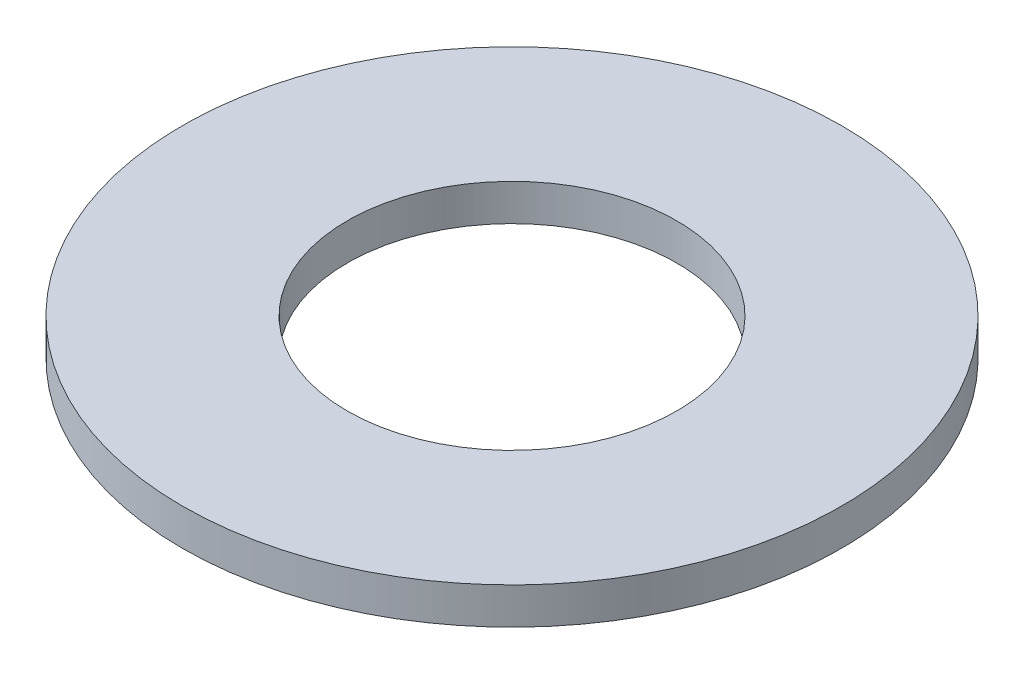
ISO-10303-21;
HEADER;
FILE_DESCRIPTION(('STEP AP214'),'2;1');
FILE_NAME('part.step','',(''),(''),'','','');
FILE_SCHEMA(('AUTOMOTIVE_DESIGN { 1 0 10303 214 1 1 1 1 }'));
ENDSEC;
DATA;
#1=APPLICATION_CONTEXT('core data for automotive mechanical design processes');
#2=APPLICATION_PROTOCOL_DEFINITION('international standard','automotive_design',2000,#1);
#3=PRODUCT_CONTEXT('',#1,'mechanical');
#4=PRODUCT('Part','Part','',(#3));
#5=PRODUCT_RELATED_PRODUCT_CATEGORY('part','',(#4));
#6=PRODUCT_DEFINITION_FORMATION('','',#4);
#7=PRODUCT_DEFINITION_CONTEXT('part definition',#1,'design');
#8=PRODUCT_DEFINITION('design','',#6,#7);
#9=PRODUCT_DEFINITION_SHAPE('','',#8);
#10=(LENGTH_UNIT() NAMED_UNIT(*) SI_UNIT(.MILLI.,.METRE.));
#11=(NAMED_UNIT(*) PLANE_ANGLE_UNIT() SI_UNIT($,.RADIAN.));
#12=(NAMED_UNIT(*) SI_UNIT($,.STERADIAN.) SOLID_ANGLE_UNIT());
#13=UNCERTAINTY_MEASURE_WITH_UNIT(LENGTH_MEASURE(1.E-05),#10,'distance_accuracy_value','');
#14=(GEOMETRIC_REPRESENTATION_CONTEXT(3) GLOBAL_UNCERTAINTY_ASSIGNED_CONTEXT((#13)) GLOBAL_UNIT_ASSIGNED_CONTEXT((#10,
#11,#12)) REPRESENTATION_CONTEXT('',''));
#15=CARTESIAN_POINT('',(0.,0.,0.));
#16=DIRECTION('',(0.,0.,1.));
#17=DIRECTION('',(1.,0.,0.));
#18=AXIS2_PLACEMENT_3D('',#15,#16,#17);
#19=CARTESIAN_POINT('',(0.,5.,0.));
#20=DIRECTION('',(0.,-1.,0.));
#21=DIRECTION('',(0.,0.,-1.));
#22=AXIS2_PLACEMENT_3D('',#19,#20,#21);
#23=CYLINDRICAL_SURFACE('',#22,45.);
#24=CARTESIAN_POINT('',(0.,5.,0.));
#25=DIRECTION('',(0.,1.,0.));
#26=DIRECTION('',(0.,0.,1.));
#27=AXIS2_PLACEMENT_3D('',#24,#25,#26);
#28=CIRCLE('',#27,45.);
#29=CARTESIAN_POINT('',(0.,5.,45.));
#30=VERTEX_POINT('',#29);
#31=EDGE_CURVE('E10',#30,#30,#28,.T.);
#32=ORIENTED_EDGE('',*,*,#31,.F.);
#33=EDGE_LOOP('',(#32));
#34=FACE_BOUND('',#33,.T.);
#35=CARTESIAN_POINT('',(0.,0.,0.));
#36=DIRECTION('',(0.,1.,0.));
#37=DIRECTION('',(0.,0.,1.));
#38=AXIS2_PLACEMENT_3D('',#35,#36,#37);
#39=CIRCLE('',#38,45.);
#40=CARTESIAN_POINT('',(0.,0.,45.));
#41=VERTEX_POINT('',#40);
#42=EDGE_CURVE('E37',#41,#41,#39,.T.);
#43=ORIENTED_EDGE('',*,*,#42,.T.);
#44=EDGE_LOOP('',(#43));
#45=FACE_BOUND('',#44,.T.);
#46=ADVANCED_FACE('F40',(#34,#45),#23,.T.);
#47=CARTESIAN_POINT('',(0.,5.,0.));
#48=DIRECTION('',(0.,1.,0.));
#49=DIRECTION('',(0.,0.,1.));
#50=AXIS2_PLACEMENT_3D('',#47,#48,#49);
#51=PLANE('',#50);
#52=CARTESIAN_POINT('',(0.,5.,0.));
#53=DIRECTION('',(0.,1.,0.));
#54=DIRECTION('',(0.,0.,1.));
#55=AXIS2_PLACEMENT_3D('',#52,#53,#54);
#56=CIRCLE('',#55,22.5);
#57=CARTESIAN_POINT('',(0.,5.,22.5));
#58=VERTEX_POINT('',#57);
#59=EDGE_CURVE('E50',#58,#58,#56,.T.);
#60=ORIENTED_EDGE('',*,*,#59,.F.);
#61=EDGE_LOOP('',(#60));
#62=FACE_BOUND('',#61,.T.);
#63=ORIENTED_EDGE('',*,*,#31,.T.);
#64=EDGE_LOOP('',(#63));
#65=FACE_BOUND('',#64,.T.);
#66=ADVANCED_FACE('F59',(#62,#65),#51,.T.);
#67=CARTESIAN_POINT('',(0.,0.,0.));
#68=DIRECTION('',(0.,1.,0.));
#69=DIRECTION('',(0.,0.,1.));
#70=AXIS2_PLACEMENT_3D('',#67,#68,#69);
#71=PLANE('',#70);
#72=CARTESIAN_POINT('',(0.,0.,0.));
#73=DIRECTION('',(0.,1.,0.));
#74=DIRECTION('',(0.,0.,1.));
#75=AXIS2_PLACEMENT_3D('',#72,#73,#74);
#76=CIRCLE('',#75,22.5);
#77=CARTESIAN_POINT('',(0.,0.,22.5));
#78=VERTEX_POINT('',#77);
#79=EDGE_CURVE('E47',#78,#78,#76,.T.);
#80=ORIENTED_EDGE('',*,*,#79,.T.);
#81=EDGE_LOOP('',(#80));
#82=FACE_BOUND('',#81,.T.);
#83=ORIENTED_EDGE('',*,*,#42,.F.);
#84=EDGE_LOOP('',(#83));
#85=FACE_BOUND('',#84,.T.);
#86=ADVANCED_FACE('F58',(#82,#85),#71,.F.);
#87=CARTESIAN_POINT('',(0.,5.,0.));
#88=DIRECTION('',(0.,-1.,0.));
#89=DIRECTION('',(0.,0.,-1.));
#90=AXIS2_PLACEMENT_3D('',#87,#88,#89);
#91=CYLINDRICAL_SURFACE('',#90,22.5);
#92=ORIENTED_EDGE('',*,*,#59,.T.);
#93=EDGE_LOOP('',(#92));
#94=FACE_BOUND('',#93,.T.);
#95=ORIENTED_EDGE('',*,*,#79,.F.);
#96=EDGE_LOOP('',(#95));
#97=FACE_BOUND('',#96,.T.);
#98=ADVANCED_FACE('F54',(#94,#97),#91,.F.);
#99=CLOSED_SHELL('',(#46,#66,#86,#98));
#100=MANIFOLD_SOLID_BREP('B2',#99);
#101=ADVANCED_BREP_SHAPE_REPRESENTATION('',(#18,#100),#14);
#102=SHAPE_DEFINITION_REPRESENTATION(#9,#101);
ENDSEC;
END-ISO-10303-21;
